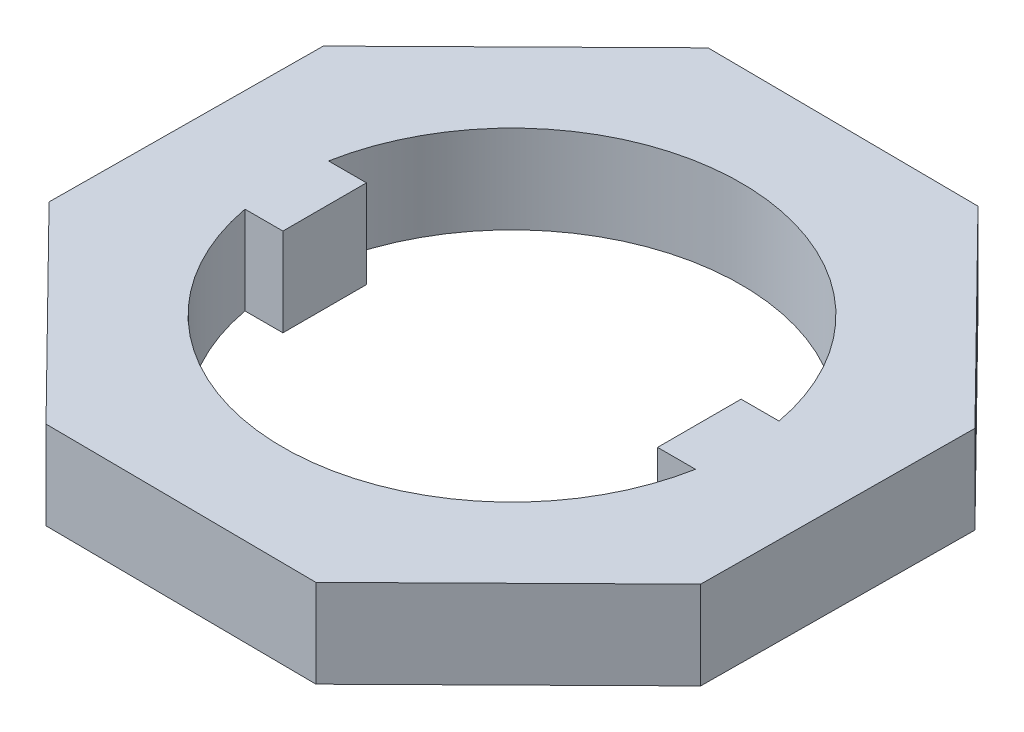
ISO-10303-21;
HEADER;
FILE_DESCRIPTION(('STEP AP214'),'2;1');
FILE_NAME('part.step','',(''),(''),'','','');
FILE_SCHEMA(('AUTOMOTIVE_DESIGN { 1 0 10303 214 1 1 1 1 }'));
ENDSEC;
DATA;
#1=APPLICATION_CONTEXT('core data for automotive mechanical design processes');
#2=APPLICATION_PROTOCOL_DEFINITION('international standard','automotive_design',2000,#1);
#3=PRODUCT_CONTEXT('',#1,'mechanical');
#4=PRODUCT('Part','Part','',(#3));
#5=PRODUCT_RELATED_PRODUCT_CATEGORY('part','',(#4));
#6=PRODUCT_DEFINITION_FORMATION('','',#4);
#7=PRODUCT_DEFINITION_CONTEXT('part definition',#1,'design');
#8=PRODUCT_DEFINITION('design','',#6,#7);
#9=PRODUCT_DEFINITION_SHAPE('','',#8);
#10=(LENGTH_UNIT() NAMED_UNIT(*) SI_UNIT(.MILLI.,.METRE.));
#11=(NAMED_UNIT(*) PLANE_ANGLE_UNIT() SI_UNIT($,.RADIAN.));
#12=(NAMED_UNIT(*) SI_UNIT($,.STERADIAN.) SOLID_ANGLE_UNIT());
#13=UNCERTAINTY_MEASURE_WITH_UNIT(LENGTH_MEASURE(1.E-05),#10,'distance_accuracy_value','');
#14=(GEOMETRIC_REPRESENTATION_CONTEXT(3) GLOBAL_UNCERTAINTY_ASSIGNED_CONTEXT((#13)) GLOBAL_UNIT_ASSIGNED_CONTEXT((#10,
#11,#12)) REPRESENTATION_CONTEXT('',''));
#15=CARTESIAN_POINT('',(0.,0.,0.));
#16=DIRECTION('',(0.,0.,1.));
#17=DIRECTION('',(1.,0.,0.));
#18=AXIS2_PLACEMENT_3D('',#15,#16,#17);
#19=CARTESIAN_POINT('',(0.,1.9,0.));
#20=DIRECTION('',(0.,1.,0.));
#21=DIRECTION('',(0.,0.,1.));
#22=AXIS2_PLACEMENT_3D('',#19,#20,#21);
#23=PLANE('',#22);
#24=DIRECTION('',(0.00799726626794846,0.,-0.999968021354803));
#25=VECTOR('',#24,1.);
#26=CARTESIAN_POINT('',(7.05461620211651,1.9,2.98843689803246));
#27=LINE('',#26,#25);
#28=CARTESIAN_POINT('',(7.05461620211651,1.9,2.98843689803246));
#29=VERTEX_POINT('',#28);
#30=CARTESIAN_POINT('',(7.10151095093191,1.9,-2.87522295943822));
#31=VERTEX_POINT('',#30);
#32=EDGE_CURVE('E211',#29,#31,#27,.T.);
#33=ORIENTED_EDGE('',*,*,#32,.T.);
#34=DIRECTION('',(-0.701429247660654,0.,-0.712739090078697));
#35=VECTOR('',#34,1.);
#36=CARTESIAN_POINT('',(7.10151095093191,1.9,-2.87522295943822));
#37=LINE('',#36,#35);
#38=CARTESIAN_POINT('',(2.98843689803247,1.9,-7.0546162021165));
#39=VERTEX_POINT('',#38);
#40=EDGE_CURVE('E214',#31,#39,#37,.T.);
#41=ORIENTED_EDGE('',*,*,#40,.T.);
#42=DIRECTION('',(-0.999968021354803,0.,-0.00799726626794919));
#43=VECTOR('',#42,1.);
#44=CARTESIAN_POINT('',(2.98843689803247,1.9,-7.0546162021165));
#45=LINE('',#44,#43);
#46=CARTESIAN_POINT('',(-2.87522295943822,1.9,-7.10151095093191));
#47=VERTEX_POINT('',#46);
#48=EDGE_CURVE('E217',#39,#47,#45,.T.);
#49=ORIENTED_EDGE('',*,*,#48,.T.);
#50=DIRECTION('',(-0.712739090078697,0.,0.701429247660654));
#51=VECTOR('',#50,1.);
#52=CARTESIAN_POINT('',(-2.87522295943822,1.9,-7.10151095093191));
#53=LINE('',#52,#51);
#54=CARTESIAN_POINT('',(-7.0546162021165,1.9,-2.98843689803247));
#55=VERTEX_POINT('',#54);
#56=EDGE_CURVE('E219',#47,#55,#53,.T.);
#57=ORIENTED_EDGE('',*,*,#56,.T.);
#58=DIRECTION('',(-0.00799726626794934,0.,0.999968021354803));
#59=VECTOR('',#58,1.);
#60=CARTESIAN_POINT('',(-7.0546162021165,1.9,-2.98843689803247));
#61=LINE('',#60,#59);
#62=CARTESIAN_POINT('',(-7.10151095093191,1.9,2.87522295943822));
#63=VERTEX_POINT('',#62);
#64=EDGE_CURVE('E221',#55,#63,#61,.T.);
#65=ORIENTED_EDGE('',*,*,#64,.T.);
#66=DIRECTION('',(0.701429247660654,0.,0.712739090078697));
#67=VECTOR('',#66,1.);
#68=CARTESIAN_POINT('',(-7.10151095093191,1.9,2.87522295943822));
#69=LINE('',#68,#67);
#70=CARTESIAN_POINT('',(-2.98843689803246,1.9,7.0546162021165));
#71=VERTEX_POINT('',#70);
#72=EDGE_CURVE('E223',#63,#71,#69,.T.);
#73=ORIENTED_EDGE('',*,*,#72,.T.);
#74=DIRECTION('',(0.999968021354803,0.,0.00799726626794904));
#75=VECTOR('',#74,1.);
#76=CARTESIAN_POINT('',(-2.98843689803246,1.9,7.0546162021165));
#77=LINE('',#76,#75);
#78=CARTESIAN_POINT('',(2.87522295943822,1.9,7.10151095093191));
#79=VERTEX_POINT('',#78);
#80=EDGE_CURVE('E225',#71,#79,#77,.T.);
#81=ORIENTED_EDGE('',*,*,#80,.T.);
#82=DIRECTION('',(0.712739090078697,0.,-0.701429247660654));
#83=VECTOR('',#82,1.);
#84=CARTESIAN_POINT('',(2.87522295943822,1.9,7.10151095093191));
#85=LINE('',#84,#83);
#86=EDGE_CURVE('E227',#79,#29,#85,.T.);
#87=ORIENTED_EDGE('',*,*,#86,.T.);
#88=EDGE_LOOP('',(#33,#41,#49,#57,#65,#73,#81,#87));
#89=FACE_BOUND('',#88,.T.);
#90=DIRECTION('',(1.,0.,0.));
#91=VECTOR('',#90,1.);
#92=CARTESIAN_POINT('',(-4.85461502252295,1.9,-0.9));
#93=LINE('',#92,#91);
#94=CARTESIAN_POINT('',(-4.85461502252295,1.9,-0.9));
#95=VERTEX_POINT('',#94);
#96=CARTESIAN_POINT('',(-4.03733602430557,1.9,-0.9));
#97=VERTEX_POINT('',#96);
#98=EDGE_CURVE('E154',#95,#97,#93,.T.);
#99=ORIENTED_EDGE('',*,*,#98,.F.);
#100=CARTESIAN_POINT('',(0.,1.9,0.));
#101=DIRECTION('',(0.,1.,0.));
#102=DIRECTION('',(0.,0.,1.));
#103=AXIS2_PLACEMENT_3D('',#100,#101,#102);
#104=CIRCLE('',#103,4.93733602430557);
#105=CARTESIAN_POINT('',(4.85461502252295,1.9,-0.9));
#106=VERTEX_POINT('',#105);
#107=EDGE_CURVE('E146',#106,#95,#104,.T.);
#108=ORIENTED_EDGE('',*,*,#107,.F.);
#109=DIRECTION('',(1.,0.,0.));
#110=VECTOR('',#109,1.);
#111=CARTESIAN_POINT('',(4.85461502252295,1.9,-0.9));
#112=LINE('',#111,#110);
#113=CARTESIAN_POINT('',(4.03733602430557,1.9,-0.9));
#114=VERTEX_POINT('',#113);
#115=EDGE_CURVE('E179',#114,#106,#112,.T.);
#116=ORIENTED_EDGE('',*,*,#115,.F.);
#117=DIRECTION('',(0.,0.,-1.));
#118=VECTOR('',#117,1.);
#119=CARTESIAN_POINT('',(4.03733602430557,1.9,-0.9));
#120=LINE('',#119,#118);
#121=CARTESIAN_POINT('',(4.03733602430557,1.9,0.9));
#122=VERTEX_POINT('',#121);
#123=EDGE_CURVE('E177',#122,#114,#120,.T.);
#124=ORIENTED_EDGE('',*,*,#123,.F.);
#125=DIRECTION('',(-1.,0.,0.));
#126=VECTOR('',#125,1.);
#127=CARTESIAN_POINT('',(4.03733602430557,1.9,0.9));
#128=LINE('',#127,#126);
#129=CARTESIAN_POINT('',(4.85461502252295,1.9,0.899999999999999));
#130=VERTEX_POINT('',#129);
#131=EDGE_CURVE('E175',#130,#122,#128,.T.);
#132=ORIENTED_EDGE('',*,*,#131,.F.);
#133=CARTESIAN_POINT('',(0.,1.9,0.));
#134=DIRECTION('',(0.,1.,0.));
#135=DIRECTION('',(0.,0.,1.));
#136=AXIS2_PLACEMENT_3D('',#133,#134,#135);
#137=CIRCLE('',#136,4.93733602430557);
#138=CARTESIAN_POINT('',(-4.85461502252295,1.9,0.9));
#139=VERTEX_POINT('',#138);
#140=EDGE_CURVE('E173',#139,#130,#137,.T.);
#141=ORIENTED_EDGE('',*,*,#140,.F.);
#142=DIRECTION('',(-1.,0.,0.));
#143=VECTOR('',#142,1.);
#144=CARTESIAN_POINT('',(-4.03733602430557,1.9,0.9));
#145=LINE('',#144,#143);
#146=CARTESIAN_POINT('',(-4.03733602430557,1.9,0.9));
#147=VERTEX_POINT('',#146);
#148=EDGE_CURVE('E169',#147,#139,#145,.T.);
#149=ORIENTED_EDGE('',*,*,#148,.F.);
#150=DIRECTION('',(0.,0.,1.));
#151=VECTOR('',#150,1.);
#152=CARTESIAN_POINT('',(-4.03733602430557,1.9,-0.9));
#153=LINE('',#152,#151);
#154=EDGE_CURVE('E167',#97,#147,#153,.T.);
#155=ORIENTED_EDGE('',*,*,#154,.F.);
#156=EDGE_LOOP('',(#99,#108,#116,#124,#132,#141,#149,#155));
#157=FACE_BOUND('',#156,.T.);
#158=ADVANCED_FACE('F33',(#89,#157),#23,.T.);
#159=CARTESIAN_POINT('',(0.,0.,0.));
#160=DIRECTION('',(0.,1.,0.));
#161=DIRECTION('',(0.,0.,1.));
#162=AXIS2_PLACEMENT_3D('',#159,#160,#161);
#163=PLANE('',#162);
#164=DIRECTION('',(0.00799726626794846,0.,-0.999968021354803));
#165=VECTOR('',#164,1.);
#166=CARTESIAN_POINT('',(7.05461620211651,0.,2.98843689803246));
#167=LINE('',#166,#165);
#168=CARTESIAN_POINT('',(7.05461620211651,0.,2.98843689803246));
#169=VERTEX_POINT('',#168);
#170=CARTESIAN_POINT('',(7.10151095093191,0.,-2.87522295943822));
#171=VERTEX_POINT('',#170);
#172=EDGE_CURVE('E162',#169,#171,#167,.T.);
#173=ORIENTED_EDGE('',*,*,#172,.F.);
#174=DIRECTION('',(0.712739090078697,0.,-0.701429247660654));
#175=VECTOR('',#174,1.);
#176=CARTESIAN_POINT('',(2.87522295943822,0.,7.10151095093191));
#177=LINE('',#176,#175);
#178=CARTESIAN_POINT('',(2.87522295943822,0.,7.10151095093191));
#179=VERTEX_POINT('',#178);
#180=EDGE_CURVE('E215',#179,#169,#177,.T.);
#181=ORIENTED_EDGE('',*,*,#180,.F.);
#182=DIRECTION('',(0.999968021354803,0.,0.00799726626794904));
#183=VECTOR('',#182,1.);
#184=CARTESIAN_POINT('',(-2.98843689803246,0.,7.0546162021165));
#185=LINE('',#184,#183);
#186=CARTESIAN_POINT('',(-2.98843689803246,0.,7.0546162021165));
#187=VERTEX_POINT('',#186);
#188=EDGE_CURVE('E242',#187,#179,#185,.T.);
#189=ORIENTED_EDGE('',*,*,#188,.F.);
#190=DIRECTION('',(0.701429247660654,0.,0.712739090078697));
#191=VECTOR('',#190,1.);
#192=CARTESIAN_POINT('',(-7.10151095093191,0.,2.87522295943822));
#193=LINE('',#192,#191);
#194=CARTESIAN_POINT('',(-7.10151095093191,0.,2.87522295943822));
#195=VERTEX_POINT('',#194);
#196=EDGE_CURVE('E240',#195,#187,#193,.T.);
#197=ORIENTED_EDGE('',*,*,#196,.F.);
#198=DIRECTION('',(-0.00799726626794934,0.,0.999968021354803));
#199=VECTOR('',#198,1.);
#200=CARTESIAN_POINT('',(-7.0546162021165,0.,-2.98843689803247));
#201=LINE('',#200,#199);
#202=CARTESIAN_POINT('',(-7.0546162021165,0.,-2.98843689803247));
#203=VERTEX_POINT('',#202);
#204=EDGE_CURVE('E238',#203,#195,#201,.T.);
#205=ORIENTED_EDGE('',*,*,#204,.F.);
#206=DIRECTION('',(-0.712739090078697,0.,0.701429247660654));
#207=VECTOR('',#206,1.);
#208=CARTESIAN_POINT('',(-2.87522295943822,0.,-7.10151095093191));
#209=LINE('',#208,#207);
#210=CARTESIAN_POINT('',(-2.87522295943822,0.,-7.10151095093191));
#211=VERTEX_POINT('',#210);
#212=EDGE_CURVE('E236',#211,#203,#209,.T.);
#213=ORIENTED_EDGE('',*,*,#212,.F.);
#214=DIRECTION('',(-0.999968021354803,0.,-0.00799726626794919));
#215=VECTOR('',#214,1.);
#216=CARTESIAN_POINT('',(2.98843689803247,0.,-7.0546162021165));
#217=LINE('',#216,#215);
#218=CARTESIAN_POINT('',(2.98843689803247,0.,-7.0546162021165));
#219=VERTEX_POINT('',#218);
#220=EDGE_CURVE('E234',#219,#211,#217,.T.);
#221=ORIENTED_EDGE('',*,*,#220,.F.);
#222=DIRECTION('',(-0.701429247660654,0.,-0.712739090078697));
#223=VECTOR('',#222,1.);
#224=CARTESIAN_POINT('',(7.10151095093191,0.,-2.87522295943822));
#225=LINE('',#224,#223);
#226=EDGE_CURVE('E232',#171,#219,#225,.T.);
#227=ORIENTED_EDGE('',*,*,#226,.F.);
#228=EDGE_LOOP('',(#173,#181,#189,#197,#205,#213,#221,#227));
#229=FACE_BOUND('',#228,.T.);
#230=CARTESIAN_POINT('',(0.,0.,0.));
#231=DIRECTION('',(0.,1.,0.));
#232=DIRECTION('',(0.,0.,1.));
#233=AXIS2_PLACEMENT_3D('',#230,#231,#232);
#234=CIRCLE('',#233,4.93733602430557);
#235=CARTESIAN_POINT('',(4.85461502252295,0.,-0.9));
#236=VERTEX_POINT('',#235);
#237=CARTESIAN_POINT('',(-4.85461502252295,0.,-0.9));
#238=VERTEX_POINT('',#237);
#239=EDGE_CURVE('E56',#236,#238,#234,.T.);
#240=ORIENTED_EDGE('',*,*,#239,.T.);
#241=DIRECTION('',(1.,0.,0.));
#242=VECTOR('',#241,1.);
#243=CARTESIAN_POINT('',(-4.85461502252295,0.,-0.9));
#244=LINE('',#243,#242);
#245=CARTESIAN_POINT('',(-4.03733602430557,0.,-0.9));
#246=VERTEX_POINT('',#245);
#247=EDGE_CURVE('E161',#238,#246,#244,.T.);
#248=ORIENTED_EDGE('',*,*,#247,.T.);
#249=DIRECTION('',(0.,0.,1.));
#250=VECTOR('',#249,1.);
#251=CARTESIAN_POINT('',(-4.03733602430557,0.,-0.9));
#252=LINE('',#251,#250);
#253=CARTESIAN_POINT('',(-4.03733602430557,0.,0.9));
#254=VERTEX_POINT('',#253);
#255=EDGE_CURVE('E183',#246,#254,#252,.T.);
#256=ORIENTED_EDGE('',*,*,#255,.T.);
#257=DIRECTION('',(-1.,0.,0.));
#258=VECTOR('',#257,1.);
#259=CARTESIAN_POINT('',(-4.03733602430557,0.,0.9));
#260=LINE('',#259,#258);
#261=CARTESIAN_POINT('',(-4.85461502252295,0.,0.9));
#262=VERTEX_POINT('',#261);
#263=EDGE_CURVE('E186',#254,#262,#260,.T.);
#264=ORIENTED_EDGE('',*,*,#263,.T.);
#265=CARTESIAN_POINT('',(0.,0.,0.));
#266=DIRECTION('',(0.,1.,0.));
#267=DIRECTION('',(0.,0.,1.));
#268=AXIS2_PLACEMENT_3D('',#265,#266,#267);
#269=CIRCLE('',#268,4.93733602430557);
#270=CARTESIAN_POINT('',(4.85461502252295,0.,0.899999999999999));
#271=VERTEX_POINT('',#270);
#272=EDGE_CURVE('E189',#262,#271,#269,.T.);
#273=ORIENTED_EDGE('',*,*,#272,.T.);
#274=DIRECTION('',(-1.,0.,0.));
#275=VECTOR('',#274,1.);
#276=CARTESIAN_POINT('',(4.03733602430557,0.,0.9));
#277=LINE('',#276,#275);
#278=CARTESIAN_POINT('',(4.03733602430557,0.,0.9));
#279=VERTEX_POINT('',#278);
#280=EDGE_CURVE('E192',#271,#279,#277,.T.);
#281=ORIENTED_EDGE('',*,*,#280,.T.);
#282=DIRECTION('',(0.,0.,-1.));
#283=VECTOR('',#282,1.);
#284=CARTESIAN_POINT('',(4.03733602430557,0.,-0.9));
#285=LINE('',#284,#283);
#286=CARTESIAN_POINT('',(4.03733602430557,0.,-0.9));
#287=VERTEX_POINT('',#286);
#288=EDGE_CURVE('E195',#279,#287,#285,.T.);
#289=ORIENTED_EDGE('',*,*,#288,.T.);
#290=DIRECTION('',(1.,0.,0.));
#291=VECTOR('',#290,1.);
#292=CARTESIAN_POINT('',(4.85461502252295,0.,-0.9));
#293=LINE('',#292,#291);
#294=EDGE_CURVE('E155',#287,#236,#293,.T.);
#295=ORIENTED_EDGE('',*,*,#294,.T.);
#296=EDGE_LOOP('',(#240,#248,#256,#264,#273,#281,#289,#295));
#297=FACE_BOUND('',#296,.T.);
#298=ADVANCED_FACE('F272',(#229,#297),#163,.F.);
#299=CARTESIAN_POINT('',(7.05461620211651,1.9,2.98843689803246));
#300=DIRECTION('',(-0.999968021354803,0.,-0.00799726626794846));
#301=DIRECTION('',(-0.00799726626794846,0.,0.999968021354803));
#302=AXIS2_PLACEMENT_3D('',#299,#300,#301);
#303=PLANE('',#302);
#304=ORIENTED_EDGE('',*,*,#172,.T.);
#305=DIRECTION('',(0.,-1.,0.));
#306=VECTOR('',#305,1.);
#307=CARTESIAN_POINT('',(7.10151095093191,1.9,-2.87522295943822));
#308=LINE('',#307,#306);
#309=EDGE_CURVE('E11',#31,#171,#308,.T.);
#310=ORIENTED_EDGE('',*,*,#309,.F.);
#311=ORIENTED_EDGE('',*,*,#32,.F.);
#312=DIRECTION('',(0.,-1.,0.));
#313=VECTOR('',#312,1.);
#314=CARTESIAN_POINT('',(7.05461620211651,1.9,2.98843689803246));
#315=LINE('',#314,#313);
#316=EDGE_CURVE('E229',#29,#169,#315,.T.);
#317=ORIENTED_EDGE('',*,*,#316,.T.);
#318=EDGE_LOOP('',(#304,#310,#311,#317));
#319=FACE_BOUND('',#318,.T.);
#320=ADVANCED_FACE('F35',(#319),#303,.F.);
#321=CARTESIAN_POINT('',(7.10151095093191,1.9,-2.87522295943822));
#322=DIRECTION('',(-0.712739090078697,0.,0.701429247660654));
#323=DIRECTION('',(0.701429247660654,0.,0.712739090078697));
#324=AXIS2_PLACEMENT_3D('',#321,#322,#323);
#325=PLANE('',#324);
#326=ORIENTED_EDGE('',*,*,#226,.T.);
#327=DIRECTION('',(0.,-1.,0.));
#328=VECTOR('',#327,1.);
#329=CARTESIAN_POINT('',(2.98843689803247,1.9,-7.0546162021165));
#330=LINE('',#329,#328);
#331=EDGE_CURVE('E41',#39,#219,#330,.T.);
#332=ORIENTED_EDGE('',*,*,#331,.F.);
#333=ORIENTED_EDGE('',*,*,#40,.F.);
#334=ORIENTED_EDGE('',*,*,#309,.T.);
#335=EDGE_LOOP('',(#326,#332,#333,#334));
#336=FACE_BOUND('',#335,.T.);
#337=ADVANCED_FACE('F289',(#336),#325,.F.);
#338=CARTESIAN_POINT('',(2.98843689803247,1.9,-7.0546162021165));
#339=DIRECTION('',(-0.0079972662679492,0.,0.999968021354803));
#340=DIRECTION('',(0.999968021354803,0.,0.0079972662679492));
#341=AXIS2_PLACEMENT_3D('',#338,#339,#340);
#342=PLANE('',#341);
#343=ORIENTED_EDGE('',*,*,#220,.T.);
#344=DIRECTION('',(0.,-1.,0.));
#345=VECTOR('',#344,1.);
#346=CARTESIAN_POINT('',(-2.87522295943822,1.9,-7.10151095093191));
#347=LINE('',#346,#345);
#348=EDGE_CURVE('E259',#47,#211,#347,.T.);
#349=ORIENTED_EDGE('',*,*,#348,.F.);
#350=ORIENTED_EDGE('',*,*,#48,.F.);
#351=ORIENTED_EDGE('',*,*,#331,.T.);
#352=EDGE_LOOP('',(#343,#349,#350,#351));
#353=FACE_BOUND('',#352,.T.);
#354=ADVANCED_FACE('F266',(#353),#342,.F.);
#355=CARTESIAN_POINT('',(-2.87522295943822,1.9,-7.10151095093191));
#356=DIRECTION('',(0.701429247660654,0.,0.712739090078697));
#357=DIRECTION('',(0.712739090078697,0.,-0.701429247660654));
#358=AXIS2_PLACEMENT_3D('',#355,#356,#357);
#359=PLANE('',#358);
#360=ORIENTED_EDGE('',*,*,#212,.T.);
#361=DIRECTION('',(0.,-1.,0.));
#362=VECTOR('',#361,1.);
#363=CARTESIAN_POINT('',(-7.0546162021165,1.9,-2.98843689803247));
#364=LINE('',#363,#362);
#365=EDGE_CURVE('E256',#55,#203,#364,.T.);
#366=ORIENTED_EDGE('',*,*,#365,.F.);
#367=ORIENTED_EDGE('',*,*,#56,.F.);
#368=ORIENTED_EDGE('',*,*,#348,.T.);
#369=EDGE_LOOP('',(#360,#366,#367,#368));
#370=FACE_BOUND('',#369,.T.);
#371=ADVANCED_FACE('F278',(#370),#359,.F.);
#372=CARTESIAN_POINT('',(-7.0546162021165,1.9,-2.98843689803247));
#373=DIRECTION('',(0.999968021354803,0.,0.00799726626794934));
#374=DIRECTION('',(0.00799726626794934,0.,-0.999968021354803));
#375=AXIS2_PLACEMENT_3D('',#372,#373,#374);
#376=PLANE('',#375);
#377=ORIENTED_EDGE('',*,*,#204,.T.);
#378=DIRECTION('',(0.,-1.,0.));
#379=VECTOR('',#378,1.);
#380=CARTESIAN_POINT('',(-7.10151095093191,1.9,2.87522295943822));
#381=LINE('',#380,#379);
#382=EDGE_CURVE('E253',#63,#195,#381,.T.);
#383=ORIENTED_EDGE('',*,*,#382,.F.);
#384=ORIENTED_EDGE('',*,*,#64,.F.);
#385=ORIENTED_EDGE('',*,*,#365,.T.);
#386=EDGE_LOOP('',(#377,#383,#384,#385));
#387=FACE_BOUND('',#386,.T.);
#388=ADVANCED_FACE('F282',(#387),#376,.F.);
#389=CARTESIAN_POINT('',(-7.10151095093191,1.9,2.87522295943822));
#390=DIRECTION('',(0.712739090078697,0.,-0.701429247660654));
#391=DIRECTION('',(-0.701429247660654,0.,-0.712739090078697));
#392=AXIS2_PLACEMENT_3D('',#389,#390,#391);
#393=PLANE('',#392);
#394=ORIENTED_EDGE('',*,*,#196,.T.);
#395=DIRECTION('',(0.,-1.,0.));
#396=VECTOR('',#395,1.);
#397=CARTESIAN_POINT('',(-2.98843689803246,1.9,7.0546162021165));
#398=LINE('',#397,#396);
#399=EDGE_CURVE('E250',#71,#187,#398,.T.);
#400=ORIENTED_EDGE('',*,*,#399,.F.);
#401=ORIENTED_EDGE('',*,*,#72,.F.);
#402=ORIENTED_EDGE('',*,*,#382,.T.);
#403=EDGE_LOOP('',(#394,#400,#401,#402));
#404=FACE_BOUND('',#403,.T.);
#405=ADVANCED_FACE('F302',(#404),#393,.F.);
#406=CARTESIAN_POINT('',(-2.98843689803246,1.9,7.0546162021165));
#407=DIRECTION('',(0.00799726626794904,0.,-0.999968021354803));
#408=DIRECTION('',(-0.999968021354803,0.,-0.00799726626794904));
#409=AXIS2_PLACEMENT_3D('',#406,#407,#408);
#410=PLANE('',#409);
#411=ORIENTED_EDGE('',*,*,#188,.T.);
#412=DIRECTION('',(0.,-1.,0.));
#413=VECTOR('',#412,1.);
#414=CARTESIAN_POINT('',(2.87522295943822,1.9,7.10151095093191));
#415=LINE('',#414,#413);
#416=EDGE_CURVE('E247',#79,#179,#415,.T.);
#417=ORIENTED_EDGE('',*,*,#416,.F.);
#418=ORIENTED_EDGE('',*,*,#80,.F.);
#419=ORIENTED_EDGE('',*,*,#399,.T.);
#420=EDGE_LOOP('',(#411,#417,#418,#419));
#421=FACE_BOUND('',#420,.T.);
#422=ADVANCED_FACE('F300',(#421),#410,.F.);
#423=CARTESIAN_POINT('',(2.87522295943822,1.9,7.10151095093191));
#424=DIRECTION('',(-0.701429247660654,0.,-0.712739090078697));
#425=DIRECTION('',(-0.712739090078697,0.,0.701429247660654));
#426=AXIS2_PLACEMENT_3D('',#423,#424,#425);
#427=PLANE('',#426);
#428=ORIENTED_EDGE('',*,*,#180,.T.);
#429=ORIENTED_EDGE('',*,*,#316,.F.);
#430=ORIENTED_EDGE('',*,*,#86,.F.);
#431=ORIENTED_EDGE('',*,*,#416,.T.);
#432=EDGE_LOOP('',(#428,#429,#430,#431));
#433=FACE_BOUND('',#432,.T.);
#434=ADVANCED_FACE('F295',(#433),#427,.F.);
#435=CARTESIAN_POINT('',(0.,1.9,0.));
#436=DIRECTION('',(0.,-1.,0.));
#437=DIRECTION('',(0.,0.,-1.));
#438=AXIS2_PLACEMENT_3D('',#435,#436,#437);
#439=CYLINDRICAL_SURFACE('',#438,4.93733602430557);
#440=ORIENTED_EDGE('',*,*,#239,.F.);
#441=DIRECTION('',(0.,-1.,0.));
#442=VECTOR('',#441,1.);
#443=CARTESIAN_POINT('',(4.85461502252295,1.9,-0.9));
#444=LINE('',#443,#442);
#445=EDGE_CURVE('E150',#106,#236,#444,.T.);
#446=ORIENTED_EDGE('',*,*,#445,.F.);
#447=ORIENTED_EDGE('',*,*,#107,.T.);
#448=DIRECTION('',(0.,-1.,0.));
#449=VECTOR('',#448,1.);
#450=CARTESIAN_POINT('',(-4.85461502252295,1.9,-0.9));
#451=LINE('',#450,#449);
#452=EDGE_CURVE('E149',#95,#238,#451,.T.);
#453=ORIENTED_EDGE('',*,*,#452,.T.);
#454=EDGE_LOOP('',(#440,#446,#447,#453));
#455=FACE_BOUND('',#454,.T.);
#456=ADVANCED_FACE('F148',(#455),#439,.F.);
#457=CARTESIAN_POINT('',(-4.85461502252295,1.9,-0.9));
#458=DIRECTION('',(0.,0.,-1.));
#459=DIRECTION('',(-1.,0.,0.));
#460=AXIS2_PLACEMENT_3D('',#457,#458,#459);
#461=PLANE('',#460);
#462=ORIENTED_EDGE('',*,*,#247,.F.);
#463=ORIENTED_EDGE('',*,*,#452,.F.);
#464=ORIENTED_EDGE('',*,*,#98,.T.);
#465=DIRECTION('',(0.,-1.,0.));
#466=VECTOR('',#465,1.);
#467=CARTESIAN_POINT('',(-4.03733602430557,1.9,-0.9));
#468=LINE('',#467,#466);
#469=EDGE_CURVE('E163',#97,#246,#468,.T.);
#470=ORIENTED_EDGE('',*,*,#469,.T.);
#471=EDGE_LOOP('',(#462,#463,#464,#470));
#472=FACE_BOUND('',#471,.T.);
#473=ADVANCED_FACE('F158',(#472),#461,.T.);
#474=CARTESIAN_POINT('',(-4.03733602430557,1.9,-0.9));
#475=DIRECTION('',(1.,0.,0.));
#476=DIRECTION('',(0.,0.,-1.));
#477=AXIS2_PLACEMENT_3D('',#474,#475,#476);
#478=PLANE('',#477);
#479=ORIENTED_EDGE('',*,*,#255,.F.);
#480=ORIENTED_EDGE('',*,*,#469,.F.);
#481=ORIENTED_EDGE('',*,*,#154,.T.);
#482=DIRECTION('',(0.,-1.,0.));
#483=VECTOR('',#482,1.);
#484=CARTESIAN_POINT('',(-4.03733602430557,1.9,0.9));
#485=LINE('',#484,#483);
#486=EDGE_CURVE('E208',#147,#254,#485,.T.);
#487=ORIENTED_EDGE('',*,*,#486,.T.);
#488=EDGE_LOOP('',(#479,#480,#481,#487));
#489=FACE_BOUND('',#488,.T.);
#490=ADVANCED_FACE('F327',(#489),#478,.T.);
#491=CARTESIAN_POINT('',(-4.03733602430557,1.9,0.9));
#492=DIRECTION('',(0.,0.,1.));
#493=DIRECTION('',(1.,0.,0.));
#494=AXIS2_PLACEMENT_3D('',#491,#492,#493);
#495=PLANE('',#494);
#496=ORIENTED_EDGE('',*,*,#263,.F.);
#497=ORIENTED_EDGE('',*,*,#486,.F.);
#498=ORIENTED_EDGE('',*,*,#148,.T.);
#499=DIRECTION('',(0.,-1.,0.));
#500=VECTOR('',#499,1.);
#501=CARTESIAN_POINT('',(-4.85461502252295,1.9,0.9));
#502=LINE('',#501,#500);
#503=EDGE_CURVE('E206',#139,#262,#502,.T.);
#504=ORIENTED_EDGE('',*,*,#503,.T.);
#505=EDGE_LOOP('',(#496,#497,#498,#504));
#506=FACE_BOUND('',#505,.T.);
#507=ADVANCED_FACE('F331',(#506),#495,.T.);
#508=CARTESIAN_POINT('',(0.,1.9,0.));
#509=DIRECTION('',(0.,-1.,0.));
#510=DIRECTION('',(0.,0.,-1.));
#511=AXIS2_PLACEMENT_3D('',#508,#509,#510);
#512=CYLINDRICAL_SURFACE('',#511,4.93733602430557);
#513=ORIENTED_EDGE('',*,*,#272,.F.);
#514=ORIENTED_EDGE('',*,*,#503,.F.);
#515=ORIENTED_EDGE('',*,*,#140,.T.);
#516=DIRECTION('',(0.,-1.,0.));
#517=VECTOR('',#516,1.);
#518=CARTESIAN_POINT('',(4.85461502252295,1.9,0.899999999999999));
#519=LINE('',#518,#517);
#520=EDGE_CURVE('E204',#130,#271,#519,.T.);
#521=ORIENTED_EDGE('',*,*,#520,.T.);
#522=EDGE_LOOP('',(#513,#514,#515,#521));
#523=FACE_BOUND('',#522,.T.);
#524=ADVANCED_FACE('F337',(#523),#512,.F.);
#525=CARTESIAN_POINT('',(4.03733602430557,1.9,0.9));
#526=DIRECTION('',(0.,0.,1.));
#527=DIRECTION('',(1.,0.,0.));
#528=AXIS2_PLACEMENT_3D('',#525,#526,#527);
#529=PLANE('',#528);
#530=ORIENTED_EDGE('',*,*,#280,.F.);
#531=ORIENTED_EDGE('',*,*,#520,.F.);
#532=ORIENTED_EDGE('',*,*,#131,.T.);
#533=DIRECTION('',(0.,-1.,0.));
#534=VECTOR('',#533,1.);
#535=CARTESIAN_POINT('',(4.03733602430557,1.9,0.9));
#536=LINE('',#535,#534);
#537=EDGE_CURVE('E202',#122,#279,#536,.T.);
#538=ORIENTED_EDGE('',*,*,#537,.T.);
#539=EDGE_LOOP('',(#530,#531,#532,#538));
#540=FACE_BOUND('',#539,.T.);
#541=ADVANCED_FACE('F341',(#540),#529,.T.);
#542=CARTESIAN_POINT('',(4.03733602430557,1.9,-0.9));
#543=DIRECTION('',(-1.,0.,0.));
#544=DIRECTION('',(0.,0.,1.));
#545=AXIS2_PLACEMENT_3D('',#542,#543,#544);
#546=PLANE('',#545);
#547=ORIENTED_EDGE('',*,*,#288,.F.);
#548=ORIENTED_EDGE('',*,*,#537,.F.);
#549=ORIENTED_EDGE('',*,*,#123,.T.);
#550=DIRECTION('',(0.,-1.,0.));
#551=VECTOR('',#550,1.);
#552=CARTESIAN_POINT('',(4.03733602430557,1.9,-0.9));
#553=LINE('',#552,#551);
#554=EDGE_CURVE('E48',#114,#287,#553,.T.);
#555=ORIENTED_EDGE('',*,*,#554,.T.);
#556=EDGE_LOOP('',(#547,#548,#549,#555));
#557=FACE_BOUND('',#556,.T.);
#558=ADVANCED_FACE('F345',(#557),#546,.T.);
#559=CARTESIAN_POINT('',(4.85461502252295,1.9,-0.9));
#560=DIRECTION('',(0.,0.,-1.));
#561=DIRECTION('',(-1.,0.,0.));
#562=AXIS2_PLACEMENT_3D('',#559,#560,#561);
#563=PLANE('',#562);
#564=ORIENTED_EDGE('',*,*,#294,.F.);
#565=ORIENTED_EDGE('',*,*,#554,.F.);
#566=ORIENTED_EDGE('',*,*,#115,.T.);
#567=ORIENTED_EDGE('',*,*,#445,.T.);
#568=EDGE_LOOP('',(#564,#565,#566,#567));
#569=FACE_BOUND('',#568,.T.);
#570=ADVANCED_FACE('F349',(#569),#563,.T.);
#571=CLOSED_SHELL('',(#158,#298,#320,#337,#354,#371,#388,#405,#422,#434,#456,#473,#490,#507,
#524,#541,#558,#570));
#572=MANIFOLD_SOLID_BREP('B2',#571);
#573=ADVANCED_BREP_SHAPE_REPRESENTATION('',(#18,#572),#14);
#574=SHAPE_DEFINITION_REPRESENTATION(#9,#573);
ENDSEC;
END-ISO-10303-21;
